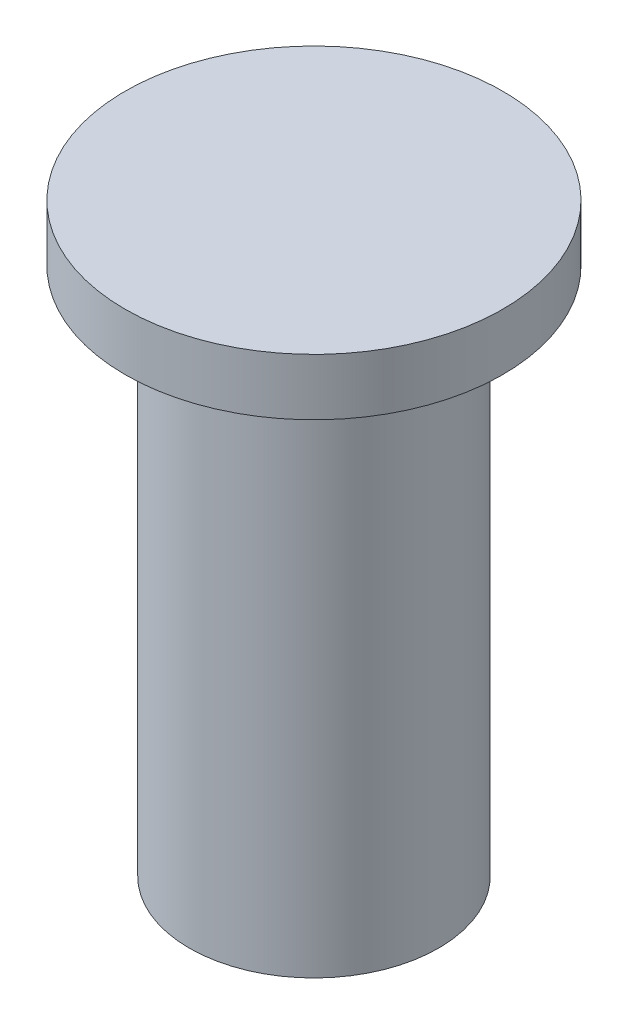
ISO-10303-21;
HEADER;
FILE_DESCRIPTION(('STEP AP214'),'2;1');
FILE_NAME('part.step','',(''),(''),'','','');
FILE_SCHEMA(('AUTOMOTIVE_DESIGN { 1 0 10303 214 1 1 1 1 }'));
ENDSEC;
DATA;
#1=APPLICATION_CONTEXT('core data for automotive mechanical design processes');
#2=APPLICATION_PROTOCOL_DEFINITION('international standard','automotive_design',2000,#1);
#3=PRODUCT_CONTEXT('',#1,'mechanical');
#4=PRODUCT('Part','Part','',(#3));
#5=PRODUCT_RELATED_PRODUCT_CATEGORY('part','',(#4));
#6=PRODUCT_DEFINITION_FORMATION('','',#4);
#7=PRODUCT_DEFINITION_CONTEXT('part definition',#1,'design');
#8=PRODUCT_DEFINITION('design','',#6,#7);
#9=PRODUCT_DEFINITION_SHAPE('','',#8);
#10=(LENGTH_UNIT() NAMED_UNIT(*) SI_UNIT(.MILLI.,.METRE.));
#11=(NAMED_UNIT(*) PLANE_ANGLE_UNIT() SI_UNIT($,.RADIAN.));
#12=(NAMED_UNIT(*) SI_UNIT($,.STERADIAN.) SOLID_ANGLE_UNIT());
#13=UNCERTAINTY_MEASURE_WITH_UNIT(LENGTH_MEASURE(1.E-05),#10,'distance_accuracy_value','');
#14=(GEOMETRIC_REPRESENTATION_CONTEXT(3) GLOBAL_UNCERTAINTY_ASSIGNED_CONTEXT((#13)) GLOBAL_UNIT_ASSIGNED_CONTEXT((#10,
#11,#12)) REPRESENTATION_CONTEXT('',''));
#15=CARTESIAN_POINT('',(0.,0.,0.));
#16=DIRECTION('',(0.,0.,1.));
#17=DIRECTION('',(1.,0.,0.));
#18=AXIS2_PLACEMENT_3D('',#15,#16,#17);
#19=CARTESIAN_POINT('',(0.,14.,0.));
#20=DIRECTION('',(0.,-1.,0.));
#21=DIRECTION('',(0.,0.,-1.));
#22=AXIS2_PLACEMENT_3D('',#19,#20,#21);
#23=CYLINDRICAL_SURFACE('',#22,3.3);
#24=CARTESIAN_POINT('',(0.,14.,0.));
#25=DIRECTION('',(0.,1.,0.));
#26=DIRECTION('',(0.,0.,1.));
#27=AXIS2_PLACEMENT_3D('',#24,#25,#26);
#28=CIRCLE('',#27,3.3);
#29=CARTESIAN_POINT('',(0.,14.,3.3));
#30=VERTEX_POINT('',#29);
#31=EDGE_CURVE('E10',#30,#30,#28,.T.);
#32=ORIENTED_EDGE('',*,*,#31,.F.);
#33=EDGE_LOOP('',(#32));
#34=FACE_BOUND('',#33,.T.);
#35=CARTESIAN_POINT('',(0.,0.,0.));
#36=DIRECTION('',(0.,1.,0.));
#37=DIRECTION('',(0.,0.,1.));
#38=AXIS2_PLACEMENT_3D('',#35,#36,#37);
#39=CIRCLE('',#38,3.3);
#40=CARTESIAN_POINT('',(0.,0.,3.3));
#41=VERTEX_POINT('',#40);
#42=EDGE_CURVE('E38',#41,#41,#39,.T.);
#43=ORIENTED_EDGE('',*,*,#42,.T.);
#44=EDGE_LOOP('',(#43));
#45=FACE_BOUND('',#44,.T.);
#46=ADVANCED_FACE('F35',(#34,#45),#23,.T.);
#47=CARTESIAN_POINT('',(0.,0.,0.));
#48=DIRECTION('',(0.,1.,0.));
#49=DIRECTION('',(0.,0.,1.));
#50=AXIS2_PLACEMENT_3D('',#47,#48,#49);
#51=PLANE('',#50);
#52=ORIENTED_EDGE('',*,*,#42,.F.);
#53=EDGE_LOOP('',(#52));
#54=FACE_BOUND('',#53,.T.);
#55=ADVANCED_FACE('F58',(#54),#51,.F.);
#56=CARTESIAN_POINT('',(0.,15.5,0.));
#57=DIRECTION('',(0.,-1.,0.));
#58=DIRECTION('',(0.,0.,-1.));
#59=AXIS2_PLACEMENT_3D('',#56,#57,#58);
#60=CYLINDRICAL_SURFACE('',#59,5.);
#61=CARTESIAN_POINT('',(0.,15.5,0.));
#62=DIRECTION('',(0.,1.,0.));
#63=DIRECTION('',(0.,0.,1.));
#64=AXIS2_PLACEMENT_3D('',#61,#62,#63);
#65=CIRCLE('',#64,5.);
#66=CARTESIAN_POINT('',(0.,15.5,5.));
#67=VERTEX_POINT('',#66);
#68=EDGE_CURVE('E45',#67,#67,#65,.T.);
#69=ORIENTED_EDGE('',*,*,#68,.F.);
#70=EDGE_LOOP('',(#69));
#71=FACE_BOUND('',#70,.T.);
#72=CARTESIAN_POINT('',(0.,14.,0.));
#73=DIRECTION('',(0.,1.,0.));
#74=DIRECTION('',(0.,0.,1.));
#75=AXIS2_PLACEMENT_3D('',#72,#73,#74);
#76=CIRCLE('',#75,5.);
#77=CARTESIAN_POINT('',(0.,14.,5.));
#78=VERTEX_POINT('',#77);
#79=EDGE_CURVE('E47',#78,#78,#76,.T.);
#80=ORIENTED_EDGE('',*,*,#79,.T.);
#81=EDGE_LOOP('',(#80));
#82=FACE_BOUND('',#81,.T.);
#83=ADVANCED_FACE('F55',(#71,#82),#60,.T.);
#84=CARTESIAN_POINT('',(0.,15.5,0.));
#85=DIRECTION('',(0.,1.,0.));
#86=DIRECTION('',(0.,0.,1.));
#87=AXIS2_PLACEMENT_3D('',#84,#85,#86);
#88=PLANE('',#87);
#89=ORIENTED_EDGE('',*,*,#68,.T.);
#90=EDGE_LOOP('',(#89));
#91=FACE_BOUND('',#90,.T.);
#92=ADVANCED_FACE('F53',(#91),#88,.T.);
#93=CARTESIAN_POINT('',(0.,14.,0.));
#94=DIRECTION('',(0.,1.,0.));
#95=DIRECTION('',(0.,0.,1.));
#96=AXIS2_PLACEMENT_3D('',#93,#94,#95);
#97=PLANE('',#96);
#98=ORIENTED_EDGE('',*,*,#31,.T.);
#99=EDGE_LOOP('',(#98));
#100=FACE_BOUND('',#99,.T.);
#101=ORIENTED_EDGE('',*,*,#79,.F.);
#102=EDGE_LOOP('',(#101));
#103=FACE_BOUND('',#102,.T.);
#104=ADVANCED_FACE('F62',(#100,#103),#97,.F.);
#105=CLOSED_SHELL('',(#46,#55,#83,#92,#104));
#106=MANIFOLD_SOLID_BREP('B2',#105);
#107=ADVANCED_BREP_SHAPE_REPRESENTATION('',(#18,#106),#14);
#108=SHAPE_DEFINITION_REPRESENTATION(#9,#107);
ENDSEC;
END-ISO-10303-21;
